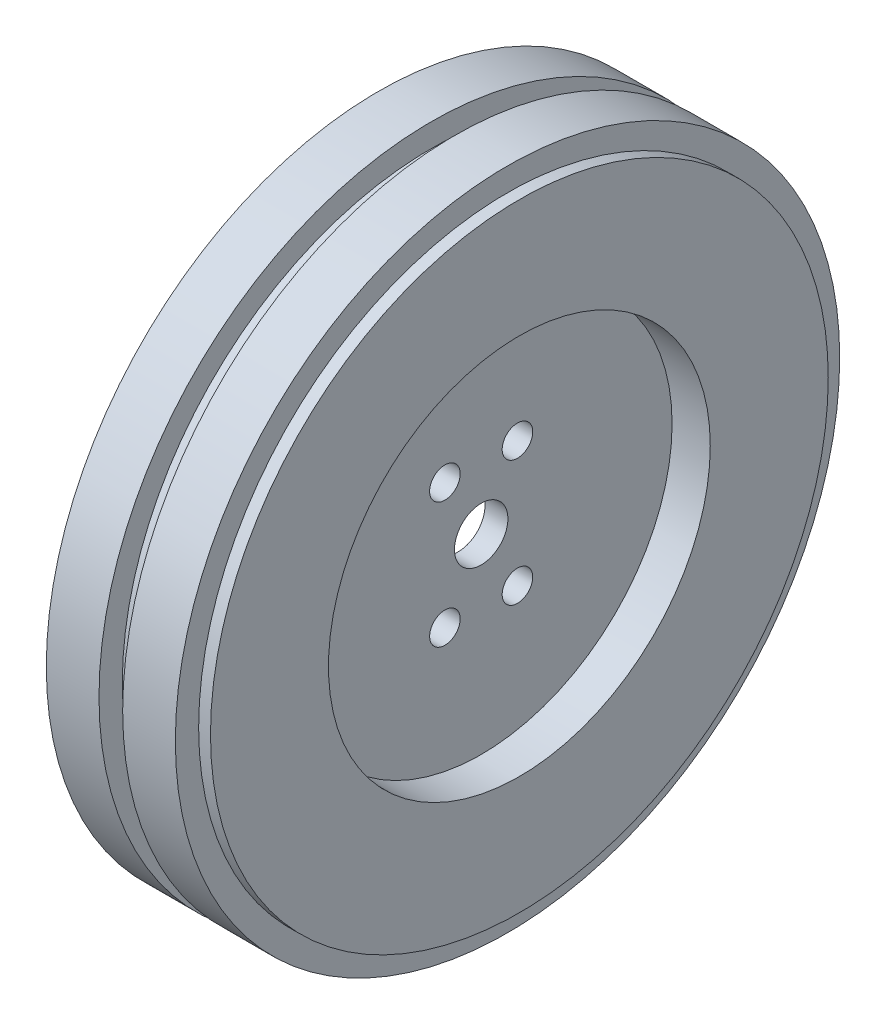
ISO-10303-21;
HEADER;
FILE_DESCRIPTION(('STEP AP214'),'2;1');
FILE_NAME('part.step','',(''),(''),'','','');
FILE_SCHEMA(('AUTOMOTIVE_DESIGN { 1 0 10303 214 1 1 1 1 }'));
ENDSEC;
DATA;
#1=APPLICATION_CONTEXT('core data for automotive mechanical design processes');
#2=APPLICATION_PROTOCOL_DEFINITION('international standard','automotive_design',2000,#1);
#3=PRODUCT_CONTEXT('',#1,'mechanical');
#4=PRODUCT('Part','Part','',(#3));
#5=PRODUCT_RELATED_PRODUCT_CATEGORY('part','',(#4));
#6=PRODUCT_DEFINITION_FORMATION('','',#4);
#7=PRODUCT_DEFINITION_CONTEXT('part definition',#1,'design');
#8=PRODUCT_DEFINITION('design','',#6,#7);
#9=PRODUCT_DEFINITION_SHAPE('','',#8);
#10=(LENGTH_UNIT() NAMED_UNIT(*) SI_UNIT(.MILLI.,.METRE.));
#11=(NAMED_UNIT(*) PLANE_ANGLE_UNIT() SI_UNIT($,.RADIAN.));
#12=(NAMED_UNIT(*) SI_UNIT($,.STERADIAN.) SOLID_ANGLE_UNIT());
#13=UNCERTAINTY_MEASURE_WITH_UNIT(LENGTH_MEASURE(1.E-05),#10,'distance_accuracy_value','');
#14=(GEOMETRIC_REPRESENTATION_CONTEXT(3) GLOBAL_UNCERTAINTY_ASSIGNED_CONTEXT((#13)) GLOBAL_UNIT_ASSIGNED_CONTEXT((#10,
#11,#12)) REPRESENTATION_CONTEXT('',''));
#15=CARTESIAN_POINT('',(0.,0.,0.));
#16=DIRECTION('',(0.,0.,1.));
#17=DIRECTION('',(1.,0.,0.));
#18=AXIS2_PLACEMENT_3D('',#15,#16,#17);
#19=CARTESIAN_POINT('',(8.00000000000001,0.,0.));
#20=DIRECTION('',(-1.,0.,0.));
#21=DIRECTION('',(0.,0.,1.));
#22=AXIS2_PLACEMENT_3D('',#19,#20,#21);
#23=CYLINDRICAL_SURFACE('',#22,43.5);
#24=CARTESIAN_POINT('',(-0.449999999999995,0.,0.));
#25=DIRECTION('',(-1.,0.,0.));
#26=DIRECTION('',(0.,0.,1.));
#27=AXIS2_PLACEMENT_3D('',#24,#25,#26);
#28=CIRCLE('',#27,43.5);
#29=CARTESIAN_POINT('',(-0.449999999999995,0.,43.5));
#30=VERTEX_POINT('',#29);
#31=EDGE_CURVE('E100',#30,#30,#28,.T.);
#32=ORIENTED_EDGE('',*,*,#31,.F.);
#33=EDGE_LOOP('',(#32));
#34=FACE_BOUND('',#33,.T.);
#35=CARTESIAN_POINT('',(6.45,0.,0.));
#36=DIRECTION('',(1.,0.,0.));
#37=DIRECTION('',(0.,0.,-1.));
#38=AXIS2_PLACEMENT_3D('',#35,#36,#37);
#39=CIRCLE('',#38,43.5);
#40=CARTESIAN_POINT('',(6.45,0.,-43.5));
#41=VERTEX_POINT('',#40);
#42=EDGE_CURVE('E106',#41,#41,#39,.T.);
#43=ORIENTED_EDGE('',*,*,#42,.F.);
#44=EDGE_LOOP('',(#43));
#45=FACE_BOUND('',#44,.T.);
#46=ADVANCED_FACE('F35',(#34,#45),#23,.T.);
#47=CARTESIAN_POINT('',(8.,40.,0.));
#48=DIRECTION('',(-1.,0.,0.));
#49=DIRECTION('',(0.,0.,1.));
#50=AXIS2_PLACEMENT_3D('',#47,#48,#49);
#51=PLANE('',#50);
#52=CARTESIAN_POINT('',(8.,0.,0.));
#53=DIRECTION('',(1.,0.,0.));
#54=DIRECTION('',(0.,0.,-1.));
#55=AXIS2_PLACEMENT_3D('',#52,#53,#54);
#56=CIRCLE('',#55,25.);
#57=CARTESIAN_POINT('',(8.,0.,-25.));
#58=VERTEX_POINT('',#57);
#59=EDGE_CURVE('E80',#58,#58,#56,.T.);
#60=ORIENTED_EDGE('',*,*,#59,.F.);
#61=EDGE_LOOP('',(#60));
#62=FACE_BOUND('',#61,.T.);
#63=CARTESIAN_POINT('',(8.,0.,0.));
#64=DIRECTION('',(1.,0.,0.));
#65=DIRECTION('',(0.,0.,-1.));
#66=AXIS2_PLACEMENT_3D('',#63,#64,#65);
#67=CIRCLE('',#66,40.45);
#68=CARTESIAN_POINT('',(8.,0.,-40.45));
#69=VERTEX_POINT('',#68);
#70=EDGE_CURVE('E110',#69,#69,#67,.T.);
#71=ORIENTED_EDGE('',*,*,#70,.T.);
#72=EDGE_LOOP('',(#71));
#73=FACE_BOUND('',#72,.T.);
#74=ADVANCED_FACE('F127',(#62,#73),#51,.F.);
#75=CARTESIAN_POINT('',(-12.,0.,0.));
#76=DIRECTION('',(-1.,0.,0.));
#77=DIRECTION('',(0.,0.,1.));
#78=AXIS2_PLACEMENT_3D('',#75,#76,#77);
#79=PLANE('',#78);
#80=CARTESIAN_POINT('',(-12.,0.,0.));
#81=DIRECTION('',(-1.,0.,0.));
#82=DIRECTION('',(0.,0.,1.));
#83=AXIS2_PLACEMENT_3D('',#80,#81,#82);
#84=CIRCLE('',#83,34.);
#85=CARTESIAN_POINT('',(-12.,0.,34.));
#86=VERTEX_POINT('',#85);
#87=EDGE_CURVE('E76',#86,#86,#84,.F.);
#88=ORIENTED_EDGE('',*,*,#87,.T.);
#89=EDGE_LOOP('',(#88));
#90=FACE_BOUND('',#89,.T.);
#91=CARTESIAN_POINT('',(-12.,0.,0.));
#92=DIRECTION('',(-1.,0.,0.));
#93=DIRECTION('',(0.,0.,1.));
#94=AXIS2_PLACEMENT_3D('',#91,#92,#93);
#95=CIRCLE('',#94,40.45);
#96=CARTESIAN_POINT('',(-12.,0.,40.45));
#97=VERTEX_POINT('',#96);
#98=EDGE_CURVE('E89',#97,#97,#95,.T.);
#99=ORIENTED_EDGE('',*,*,#98,.T.);
#100=EDGE_LOOP('',(#99));
#101=FACE_BOUND('',#100,.T.);
#102=ADVANCED_FACE('F134',(#90,#101),#79,.T.);
#103=CARTESIAN_POINT('',(-3.54999999999999,0.,0.));
#104=DIRECTION('',(-1.,0.,0.));
#105=DIRECTION('',(0.,0.,1.));
#106=AXIS2_PLACEMENT_3D('',#103,#104,#105);
#107=CIRCLE('',#106,43.5);
#108=CARTESIAN_POINT('',(-3.54999999999999,0.,43.5));
#109=VERTEX_POINT('',#108);
#110=EDGE_CURVE('E92',#109,#109,#107,.T.);
#111=ORIENTED_EDGE('',*,*,#110,.T.);
#112=EDGE_LOOP('',(#111));
#113=FACE_BOUND('',#112,.T.);
#114=CARTESIAN_POINT('',(-10.45,0.,0.));
#115=DIRECTION('',(-1.,0.,0.));
#116=DIRECTION('',(0.,0.,1.));
#117=AXIS2_PLACEMENT_3D('',#114,#115,#116);
#118=CIRCLE('',#117,43.5);
#119=CARTESIAN_POINT('',(-10.45,0.,43.5));
#120=VERTEX_POINT('',#119);
#121=EDGE_CURVE('E83',#120,#120,#118,.T.);
#122=ORIENTED_EDGE('',*,*,#121,.F.);
#123=EDGE_LOOP('',(#122));
#124=FACE_BOUND('',#123,.T.);
#125=ADVANCED_FACE('F130',(#113,#124),#23,.T.);
#126=CARTESIAN_POINT('',(-49.6444990272902,0.,0.));
#127=DIRECTION('',(-1.,0.,0.));
#128=DIRECTION('',(0.,0.,1.));
#129=AXIS2_PLACEMENT_3D('',#126,#127,#128);
#130=CYLINDRICAL_SURFACE('',#129,34.);
#131=CARTESIAN_POINT('',(0.,0.,0.));
#132=DIRECTION('',(-1.,0.,0.));
#133=DIRECTION('',(0.,0.,1.));
#134=AXIS2_PLACEMENT_3D('',#131,#132,#133);
#135=CIRCLE('',#134,34.);
#136=CARTESIAN_POINT('',(0.,0.,34.));
#137=VERTEX_POINT('',#136);
#138=EDGE_CURVE('E10',#137,#137,#135,.T.);
#139=ORIENTED_EDGE('',*,*,#138,.F.);
#140=EDGE_LOOP('',(#139));
#141=FACE_BOUND('',#140,.T.);
#142=ORIENTED_EDGE('',*,*,#87,.F.);
#143=EDGE_LOOP('',(#142));
#144=FACE_BOUND('',#143,.T.);
#145=ADVANCED_FACE('F37',(#141,#144),#130,.F.);
#146=CARTESIAN_POINT('',(0.,34.,0.));
#147=DIRECTION('',(1.,0.,0.));
#148=DIRECTION('',(0.,0.,-1.));
#149=AXIS2_PLACEMENT_3D('',#146,#147,#148);
#150=PLANE('',#149);
#151=CARTESIAN_POINT('',(0.,0.,0.));
#152=DIRECTION('',(1.,0.,0.));
#153=DIRECTION('',(0.,0.,-1.));
#154=AXIS2_PLACEMENT_3D('',#151,#152,#153);
#155=CIRCLE('',#154,3.5);
#156=CARTESIAN_POINT('',(0.,0.,-3.5));
#157=VERTEX_POINT('',#156);
#158=EDGE_CURVE('E70',#157,#157,#155,.T.);
#159=ORIENTED_EDGE('',*,*,#158,.T.);
#160=EDGE_LOOP('',(#159));
#161=FACE_BOUND('',#160,.T.);
#162=CARTESIAN_POINT('',(0.,8.22724133595216,4.75000000000001));
#163=DIRECTION('',(1.,0.,0.));
#164=DIRECTION('',(0.,0.,-1.));
#165=AXIS2_PLACEMENT_3D('',#162,#163,#164);
#166=CIRCLE('',#165,2.);
#167=CARTESIAN_POINT('',(0.,8.22724133595216,2.75000000000001));
#168=VERTEX_POINT('',#167);
#169=EDGE_CURVE('E42',#168,#168,#166,.T.);
#170=ORIENTED_EDGE('',*,*,#169,.T.);
#171=EDGE_LOOP('',(#170));
#172=FACE_BOUND('',#171,.T.);
#173=CARTESIAN_POINT('',(0.,-8.22724133595216,-4.75000000000001));
#174=DIRECTION('',(1.,0.,0.));
#175=DIRECTION('',(0.,0.,-1.));
#176=AXIS2_PLACEMENT_3D('',#173,#174,#175);
#177=CIRCLE('',#176,2.);
#178=CARTESIAN_POINT('',(0.,-8.22724133595216,-6.75000000000001));
#179=VERTEX_POINT('',#178);
#180=EDGE_CURVE('E46',#179,#179,#177,.T.);
#181=ORIENTED_EDGE('',*,*,#180,.T.);
#182=EDGE_LOOP('',(#181));
#183=FACE_BOUND('',#182,.T.);
#184=CARTESIAN_POINT('',(0.,-8.22724133595216,4.75000000000001));
#185=DIRECTION('',(1.,0.,0.));
#186=DIRECTION('',(0.,0.,-1.));
#187=AXIS2_PLACEMENT_3D('',#184,#185,#186);
#188=CIRCLE('',#187,2.);
#189=CARTESIAN_POINT('',(0.,-8.22724133595216,2.75000000000001));
#190=VERTEX_POINT('',#189);
#191=EDGE_CURVE('E50',#190,#190,#188,.T.);
#192=ORIENTED_EDGE('',*,*,#191,.T.);
#193=EDGE_LOOP('',(#192));
#194=FACE_BOUND('',#193,.T.);
#195=CARTESIAN_POINT('',(0.,8.22724133595216,-4.75000000000001));
#196=DIRECTION('',(1.,0.,0.));
#197=DIRECTION('',(0.,0.,-1.));
#198=AXIS2_PLACEMENT_3D('',#195,#196,#197);
#199=CIRCLE('',#198,2.);
#200=CARTESIAN_POINT('',(0.,8.22724133595216,-6.75000000000001));
#201=VERTEX_POINT('',#200);
#202=EDGE_CURVE('E55',#201,#201,#199,.T.);
#203=ORIENTED_EDGE('',*,*,#202,.T.);
#204=EDGE_LOOP('',(#203));
#205=FACE_BOUND('',#204,.T.);
#206=ORIENTED_EDGE('',*,*,#138,.T.);
#207=EDGE_LOOP('',(#206));
#208=FACE_BOUND('',#207,.T.);
#209=ADVANCED_FACE('F145',(#161,#172,#183,#194,#205,#208),#150,.F.);
#210=CARTESIAN_POINT('',(3.,12.5,0.));
#211=DIRECTION('',(1.,0.,0.));
#212=DIRECTION('',(0.,0.,-1.));
#213=AXIS2_PLACEMENT_3D('',#210,#211,#212);
#214=PLANE('',#213);
#215=CARTESIAN_POINT('',(3.,0.,0.));
#216=DIRECTION('',(1.,0.,0.));
#217=DIRECTION('',(0.,0.,-1.));
#218=AXIS2_PLACEMENT_3D('',#215,#216,#217);
#219=CIRCLE('',#218,3.5);
#220=CARTESIAN_POINT('',(3.,0.,-3.5));
#221=VERTEX_POINT('',#220);
#222=EDGE_CURVE('E73',#221,#221,#219,.T.);
#223=ORIENTED_EDGE('',*,*,#222,.F.);
#224=EDGE_LOOP('',(#223));
#225=FACE_BOUND('',#224,.T.);
#226=CARTESIAN_POINT('',(3.,8.22724133595216,4.75000000000001));
#227=DIRECTION('',(1.,0.,0.));
#228=DIRECTION('',(0.,0.,1.));
#229=AXIS2_PLACEMENT_3D('',#226,#227,#228);
#230=CIRCLE('',#229,2.);
#231=CARTESIAN_POINT('',(3.,8.22724133595216,6.75000000000001));
#232=VERTEX_POINT('',#231);
#233=EDGE_CURVE('E61',#232,#232,#230,.T.);
#234=ORIENTED_EDGE('',*,*,#233,.F.);
#235=EDGE_LOOP('',(#234));
#236=FACE_BOUND('',#235,.T.);
#237=CARTESIAN_POINT('',(3.,-8.22724133595216,-4.75000000000001));
#238=DIRECTION('',(1.,0.,0.));
#239=DIRECTION('',(0.,0.,1.));
#240=AXIS2_PLACEMENT_3D('',#237,#238,#239);
#241=CIRCLE('',#240,2.);
#242=CARTESIAN_POINT('',(3.,-8.22724133595216,-2.75000000000001));
#243=VERTEX_POINT('',#242);
#244=EDGE_CURVE('E62',#243,#243,#241,.T.);
#245=ORIENTED_EDGE('',*,*,#244,.F.);
#246=EDGE_LOOP('',(#245));
#247=FACE_BOUND('',#246,.T.);
#248=CARTESIAN_POINT('',(3.,-8.22724133595216,4.75000000000001));
#249=DIRECTION('',(1.,0.,0.));
#250=DIRECTION('',(0.,0.,-1.));
#251=AXIS2_PLACEMENT_3D('',#248,#249,#250);
#252=CIRCLE('',#251,2.);
#253=CARTESIAN_POINT('',(3.,-8.22724133595216,2.75000000000001));
#254=VERTEX_POINT('',#253);
#255=EDGE_CURVE('E65',#254,#254,#252,.T.);
#256=ORIENTED_EDGE('',*,*,#255,.F.);
#257=EDGE_LOOP('',(#256));
#258=FACE_BOUND('',#257,.T.);
#259=CARTESIAN_POINT('',(3.,8.22724133595216,-4.75000000000001));
#260=DIRECTION('',(1.,0.,0.));
#261=DIRECTION('',(0.,0.,-1.));
#262=AXIS2_PLACEMENT_3D('',#259,#260,#261);
#263=CIRCLE('',#262,2.);
#264=CARTESIAN_POINT('',(3.,8.22724133595216,-6.75000000000001));
#265=VERTEX_POINT('',#264);
#266=EDGE_CURVE('E58',#265,#265,#263,.T.);
#267=ORIENTED_EDGE('',*,*,#266,.F.);
#268=EDGE_LOOP('',(#267));
#269=FACE_BOUND('',#268,.T.);
#270=CARTESIAN_POINT('',(3.,0.,0.));
#271=DIRECTION('',(1.,0.,0.));
#272=DIRECTION('',(0.,0.,-1.));
#273=AXIS2_PLACEMENT_3D('',#270,#271,#272);
#274=CIRCLE('',#273,25.);
#275=CARTESIAN_POINT('',(3.,0.,-25.));
#276=VERTEX_POINT('',#275);
#277=EDGE_CURVE('E79',#276,#276,#274,.T.);
#278=ORIENTED_EDGE('',*,*,#277,.T.);
#279=EDGE_LOOP('',(#278));
#280=FACE_BOUND('',#279,.T.);
#281=ADVANCED_FACE('F236',(#225,#236,#247,#258,#269,#280),#214,.T.);
#282=CARTESIAN_POINT('',(-32.,8.22724133595216,-4.75000000000001));
#283=DIRECTION('',(1.,0.,0.));
#284=DIRECTION('',(0.,0.,-1.));
#285=AXIS2_PLACEMENT_3D('',#282,#283,#284);
#286=CYLINDRICAL_SURFACE('',#285,2.);
#287=ORIENTED_EDGE('',*,*,#266,.T.);
#288=EDGE_LOOP('',(#287));
#289=FACE_BOUND('',#288,.T.);
#290=ORIENTED_EDGE('',*,*,#202,.F.);
#291=EDGE_LOOP('',(#290));
#292=FACE_BOUND('',#291,.T.);
#293=ADVANCED_FACE('F240',(#289,#292),#286,.F.);
#294=CARTESIAN_POINT('',(-32.,-8.22724133595216,4.75000000000001));
#295=DIRECTION('',(1.,0.,0.));
#296=DIRECTION('',(0.,0.,-1.));
#297=AXIS2_PLACEMENT_3D('',#294,#295,#296);
#298=CYLINDRICAL_SURFACE('',#297,2.);
#299=ORIENTED_EDGE('',*,*,#255,.T.);
#300=EDGE_LOOP('',(#299));
#301=FACE_BOUND('',#300,.T.);
#302=ORIENTED_EDGE('',*,*,#191,.F.);
#303=EDGE_LOOP('',(#302));
#304=FACE_BOUND('',#303,.T.);
#305=ADVANCED_FACE('F286',(#301,#304),#298,.F.);
#306=CARTESIAN_POINT('',(-32.,-8.22724133595216,-4.75000000000001));
#307=DIRECTION('',(1.,0.,0.));
#308=DIRECTION('',(0.,0.,-1.));
#309=AXIS2_PLACEMENT_3D('',#306,#307,#308);
#310=CYLINDRICAL_SURFACE('',#309,2.);
#311=ORIENTED_EDGE('',*,*,#244,.T.);
#312=EDGE_LOOP('',(#311));
#313=FACE_BOUND('',#312,.T.);
#314=ORIENTED_EDGE('',*,*,#180,.F.);
#315=EDGE_LOOP('',(#314));
#316=FACE_BOUND('',#315,.T.);
#317=ADVANCED_FACE('F276',(#313,#316),#310,.F.);
#318=CARTESIAN_POINT('',(-32.,8.22724133595216,4.75000000000001));
#319=DIRECTION('',(1.,0.,0.));
#320=DIRECTION('',(0.,0.,-1.));
#321=AXIS2_PLACEMENT_3D('',#318,#319,#320);
#322=CYLINDRICAL_SURFACE('',#321,2.);
#323=ORIENTED_EDGE('',*,*,#233,.T.);
#324=EDGE_LOOP('',(#323));
#325=FACE_BOUND('',#324,.T.);
#326=ORIENTED_EDGE('',*,*,#169,.F.);
#327=EDGE_LOOP('',(#326));
#328=FACE_BOUND('',#327,.T.);
#329=ADVANCED_FACE('F258',(#325,#328),#322,.F.);
#330=CARTESIAN_POINT('',(-32.,0.,0.));
#331=DIRECTION('',(1.,0.,0.));
#332=DIRECTION('',(0.,0.,-1.));
#333=AXIS2_PLACEMENT_3D('',#330,#331,#332);
#334=CYLINDRICAL_SURFACE('',#333,3.5);
#335=ORIENTED_EDGE('',*,*,#222,.T.);
#336=EDGE_LOOP('',(#335));
#337=FACE_BOUND('',#336,.T.);
#338=ORIENTED_EDGE('',*,*,#158,.F.);
#339=EDGE_LOOP('',(#338));
#340=FACE_BOUND('',#339,.T.);
#341=ADVANCED_FACE('F165',(#337,#340),#334,.F.);
#342=CARTESIAN_POINT('',(3.,0.,0.));
#343=DIRECTION('',(1.,0.,0.));
#344=DIRECTION('',(0.,0.,-1.));
#345=AXIS2_PLACEMENT_3D('',#342,#343,#344);
#346=CYLINDRICAL_SURFACE('',#345,25.);
#347=ORIENTED_EDGE('',*,*,#277,.F.);
#348=EDGE_LOOP('',(#347));
#349=FACE_BOUND('',#348,.T.);
#350=ORIENTED_EDGE('',*,*,#59,.T.);
#351=EDGE_LOOP('',(#350));
#352=FACE_BOUND('',#351,.T.);
#353=ADVANCED_FACE('F156',(#349,#352),#346,.F.);
#354=CARTESIAN_POINT('',(-10.45,0.,0.));
#355=DIRECTION('',(-1.,0.,0.));
#356=DIRECTION('',(0.,0.,1.));
#357=AXIS2_PLACEMENT_3D('',#354,#355,#356);
#358=PLANE('',#357);
#359=CARTESIAN_POINT('',(-10.45,0.,0.));
#360=DIRECTION('',(-1.,0.,0.));
#361=DIRECTION('',(0.,0.,1.));
#362=AXIS2_PLACEMENT_3D('',#359,#360,#361);
#363=CIRCLE('',#362,40.45);
#364=CARTESIAN_POINT('',(-10.45,0.,40.45));
#365=VERTEX_POINT('',#364);
#366=EDGE_CURVE('E88',#365,#365,#363,.T.);
#367=ORIENTED_EDGE('',*,*,#366,.F.);
#368=EDGE_LOOP('',(#367));
#369=FACE_BOUND('',#368,.T.);
#370=ORIENTED_EDGE('',*,*,#121,.T.);
#371=EDGE_LOOP('',(#370));
#372=FACE_BOUND('',#371,.T.);
#373=ADVANCED_FACE('F153',(#369,#372),#358,.T.);
#374=CARTESIAN_POINT('',(-10.45,0.,0.));
#375=DIRECTION('',(-1.,0.,0.));
#376=DIRECTION('',(0.,0.,1.));
#377=AXIS2_PLACEMENT_3D('',#374,#375,#376);
#378=CYLINDRICAL_SURFACE('',#377,40.45);
#379=ORIENTED_EDGE('',*,*,#366,.T.);
#380=EDGE_LOOP('',(#379));
#381=FACE_BOUND('',#380,.T.);
#382=ORIENTED_EDGE('',*,*,#98,.F.);
#383=EDGE_LOOP('',(#382));
#384=FACE_BOUND('',#383,.T.);
#385=ADVANCED_FACE('F155',(#381,#384),#378,.T.);
#386=CARTESIAN_POINT('',(-3.54999999999999,0.,0.));
#387=DIRECTION('',(-1.,0.,0.));
#388=DIRECTION('',(0.,0.,1.));
#389=AXIS2_PLACEMENT_3D('',#386,#387,#388);
#390=PLANE('',#389);
#391=ORIENTED_EDGE('',*,*,#110,.F.);
#392=EDGE_LOOP('',(#391));
#393=FACE_BOUND('',#392,.T.);
#394=CARTESIAN_POINT('',(-3.54999999999999,0.,0.));
#395=DIRECTION('',(-1.,0.,0.));
#396=DIRECTION('',(0.,0.,1.));
#397=AXIS2_PLACEMENT_3D('',#394,#395,#396);
#398=CIRCLE('',#397,40.45);
#399=CARTESIAN_POINT('',(-3.54999999999999,0.,40.45));
#400=VERTEX_POINT('',#399);
#401=EDGE_CURVE('E97',#400,#400,#398,.T.);
#402=ORIENTED_EDGE('',*,*,#401,.T.);
#403=EDGE_LOOP('',(#402));
#404=FACE_BOUND('',#403,.T.);
#405=ADVANCED_FACE('F162',(#393,#404),#390,.F.);
#406=CARTESIAN_POINT('',(-3.54999999999999,0.,0.));
#407=DIRECTION('',(1.,0.,0.));
#408=DIRECTION('',(0.,0.,-1.));
#409=AXIS2_PLACEMENT_3D('',#406,#407,#408);
#410=CYLINDRICAL_SURFACE('',#409,40.45);
#411=ORIENTED_EDGE('',*,*,#401,.F.);
#412=EDGE_LOOP('',(#411));
#413=FACE_BOUND('',#412,.T.);
#414=CARTESIAN_POINT('',(-0.449999999999995,0.,0.));
#415=DIRECTION('',(-1.,0.,0.));
#416=DIRECTION('',(0.,0.,1.));
#417=AXIS2_PLACEMENT_3D('',#414,#415,#416);
#418=CIRCLE('',#417,40.45);
#419=CARTESIAN_POINT('',(-0.449999999999995,0.,40.45));
#420=VERTEX_POINT('',#419);
#421=EDGE_CURVE('E103',#420,#420,#418,.T.);
#422=ORIENTED_EDGE('',*,*,#421,.T.);
#423=EDGE_LOOP('',(#422));
#424=FACE_BOUND('',#423,.T.);
#425=ADVANCED_FACE('F171',(#413,#424),#410,.T.);
#426=CARTESIAN_POINT('',(-0.449999999999995,0.,0.));
#427=DIRECTION('',(-1.,0.,0.));
#428=DIRECTION('',(0.,0.,1.));
#429=AXIS2_PLACEMENT_3D('',#426,#427,#428);
#430=PLANE('',#429);
#431=ORIENTED_EDGE('',*,*,#421,.F.);
#432=EDGE_LOOP('',(#431));
#433=FACE_BOUND('',#432,.T.);
#434=ORIENTED_EDGE('',*,*,#31,.T.);
#435=EDGE_LOOP('',(#434));
#436=FACE_BOUND('',#435,.T.);
#437=ADVANCED_FACE('F122',(#433,#436),#430,.T.);
#438=CARTESIAN_POINT('',(6.45,0.,0.));
#439=DIRECTION('',(1.,0.,0.));
#440=DIRECTION('',(0.,0.,-1.));
#441=AXIS2_PLACEMENT_3D('',#438,#439,#440);
#442=PLANE('',#441);
#443=CARTESIAN_POINT('',(6.45,0.,0.));
#444=DIRECTION('',(1.,0.,0.));
#445=DIRECTION('',(0.,0.,-1.));
#446=AXIS2_PLACEMENT_3D('',#443,#444,#445);
#447=CIRCLE('',#446,40.45);
#448=CARTESIAN_POINT('',(6.45,0.,-40.45));
#449=VERTEX_POINT('',#448);
#450=EDGE_CURVE('E109',#449,#449,#447,.T.);
#451=ORIENTED_EDGE('',*,*,#450,.F.);
#452=EDGE_LOOP('',(#451));
#453=FACE_BOUND('',#452,.T.);
#454=ORIENTED_EDGE('',*,*,#42,.T.);
#455=EDGE_LOOP('',(#454));
#456=FACE_BOUND('',#455,.T.);
#457=ADVANCED_FACE('F119',(#453,#456),#442,.T.);
#458=CARTESIAN_POINT('',(6.45,0.,0.));
#459=DIRECTION('',(1.,0.,0.));
#460=DIRECTION('',(0.,0.,-1.));
#461=AXIS2_PLACEMENT_3D('',#458,#459,#460);
#462=CYLINDRICAL_SURFACE('',#461,40.45);
#463=ORIENTED_EDGE('',*,*,#450,.T.);
#464=EDGE_LOOP('',(#463));
#465=FACE_BOUND('',#464,.T.);
#466=ORIENTED_EDGE('',*,*,#70,.F.);
#467=EDGE_LOOP('',(#466));
#468=FACE_BOUND('',#467,.T.);
#469=ADVANCED_FACE('F116',(#465,#468),#462,.T.);
#470=CLOSED_SHELL('',(#46,#74,#102,#125,#145,#209,#281,#293,#305,#317,#329,#341,#353,#373,#385,
#405,#425,#437,#457,#469));
#471=MANIFOLD_SOLID_BREP('B2',#470);
#472=ADVANCED_BREP_SHAPE_REPRESENTATION('',(#18,#471),#14);
#473=SHAPE_DEFINITION_REPRESENTATION(#9,#472);
ENDSEC;
END-ISO-10303-21;
